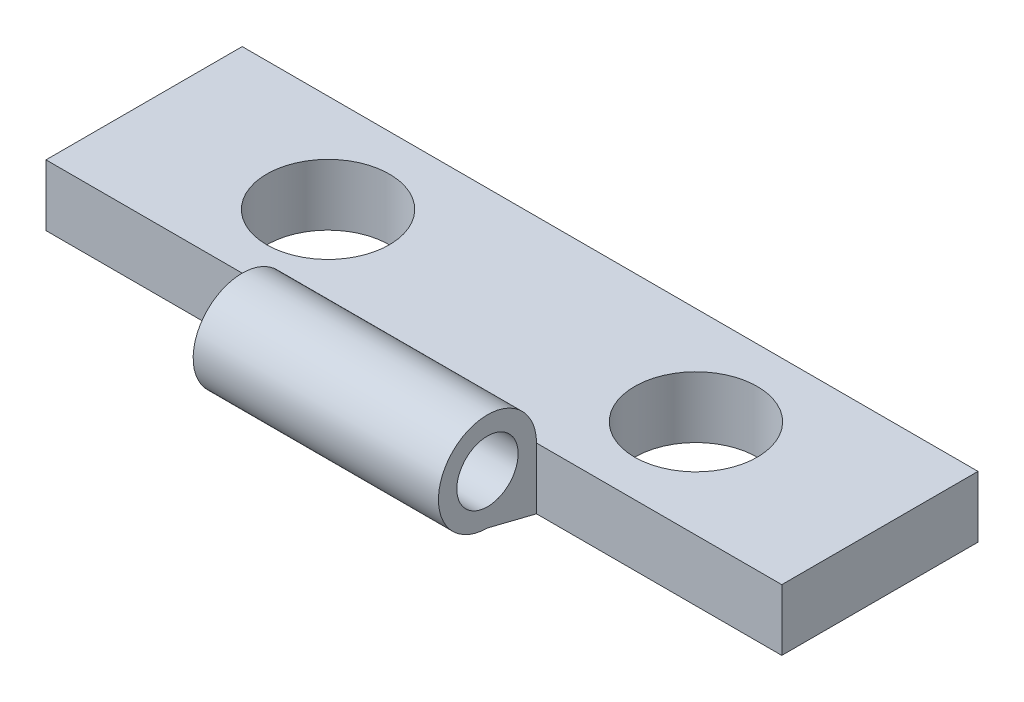
ISO-10303-21;
HEADER;
FILE_DESCRIPTION(('STEP AP214'),'2;1');
FILE_NAME('part.step','',(''),(''),'','','');
FILE_SCHEMA(('AUTOMOTIVE_DESIGN { 1 0 10303 214 1 1 1 1 }'));
ENDSEC;
DATA;
#1=APPLICATION_CONTEXT('core data for automotive mechanical design processes');
#2=APPLICATION_PROTOCOL_DEFINITION('international standard','automotive_design',2000,#1);
#3=PRODUCT_CONTEXT('',#1,'mechanical');
#4=PRODUCT('Part','Part','',(#3));
#5=PRODUCT_RELATED_PRODUCT_CATEGORY('part','',(#4));
#6=PRODUCT_DEFINITION_FORMATION('','',#4);
#7=PRODUCT_DEFINITION_CONTEXT('part definition',#1,'design');
#8=PRODUCT_DEFINITION('design','',#6,#7);
#9=PRODUCT_DEFINITION_SHAPE('','',#8);
#10=(LENGTH_UNIT() NAMED_UNIT(*) SI_UNIT(.MILLI.,.METRE.));
#11=(NAMED_UNIT(*) PLANE_ANGLE_UNIT() SI_UNIT($,.RADIAN.));
#12=(NAMED_UNIT(*) SI_UNIT($,.STERADIAN.) SOLID_ANGLE_UNIT());
#13=UNCERTAINTY_MEASURE_WITH_UNIT(LENGTH_MEASURE(1.E-05),#10,'distance_accuracy_value','');
#14=(GEOMETRIC_REPRESENTATION_CONTEXT(3) GLOBAL_UNCERTAINTY_ASSIGNED_CONTEXT((#13)) GLOBAL_UNIT_ASSIGNED_CONTEXT((#10,
#11,#12)) REPRESENTATION_CONTEXT('',''));
#15=CARTESIAN_POINT('',(0.,0.,0.));
#16=DIRECTION('',(0.,0.,1.));
#17=DIRECTION('',(1.,0.,0.));
#18=AXIS2_PLACEMENT_3D('',#15,#16,#17);
#19=CARTESIAN_POINT('',(15.,2.5,4.));
#20=DIRECTION('',(-1.,0.,0.));
#21=DIRECTION('',(0.,0.,1.));
#22=AXIS2_PLACEMENT_3D('',#19,#20,#21);
#23=PLANE('',#22);
#24=DIRECTION('',(0.,-1.,0.));
#25=VECTOR('',#24,1.);
#26=CARTESIAN_POINT('',(15.,4.5,4.));
#27=LINE('',#26,#25);
#28=CARTESIAN_POINT('',(15.,2.5,4.));
#29=VERTEX_POINT('',#28);
#30=CARTESIAN_POINT('',(15.,0.,4.));
#31=VERTEX_POINT('',#30);
#32=EDGE_CURVE('E124',#29,#31,#27,.T.);
#33=ORIENTED_EDGE('',*,*,#32,.T.);
#34=DIRECTION('',(0.,0.,-1.));
#35=VECTOR('',#34,1.);
#36=CARTESIAN_POINT('',(15.,0.,4.));
#37=LINE('',#36,#35);
#38=CARTESIAN_POINT('',(15.,0.,-4.));
#39=VERTEX_POINT('',#38);
#40=EDGE_CURVE('E86',#31,#39,#37,.T.);
#41=ORIENTED_EDGE('',*,*,#40,.T.);
#42=DIRECTION('',(0.,-1.,0.));
#43=VECTOR('',#42,1.);
#44=CARTESIAN_POINT('',(15.,2.5,-4.));
#45=LINE('',#44,#43);
#46=CARTESIAN_POINT('',(15.,2.5,-4.));
#47=VERTEX_POINT('',#46);
#48=EDGE_CURVE('E11',#47,#39,#45,.T.);
#49=ORIENTED_EDGE('',*,*,#48,.F.);
#50=DIRECTION('',(0.,0.,-1.));
#51=VECTOR('',#50,1.);
#52=CARTESIAN_POINT('',(15.,2.5,4.));
#53=LINE('',#52,#51);
#54=EDGE_CURVE('E106',#29,#47,#53,.T.);
#55=ORIENTED_EDGE('',*,*,#54,.F.);
#56=EDGE_LOOP('',(#33,#41,#49,#55));
#57=FACE_BOUND('',#56,.T.);
#58=ADVANCED_FACE('F40',(#57),#23,.F.);
#59=CARTESIAN_POINT('',(-15.,2.5,4.));
#60=DIRECTION('',(1.,0.,0.));
#61=DIRECTION('',(0.,0.,-1.));
#62=AXIS2_PLACEMENT_3D('',#59,#60,#61);
#63=PLANE('',#62);
#64=DIRECTION('',(0.,-1.,0.));
#65=VECTOR('',#64,1.);
#66=CARTESIAN_POINT('',(-15.,4.5,4.));
#67=LINE('',#66,#65);
#68=CARTESIAN_POINT('',(-15.,2.5,4.));
#69=VERTEX_POINT('',#68);
#70=CARTESIAN_POINT('',(-15.,0.,4.));
#71=VERTEX_POINT('',#70);
#72=EDGE_CURVE('E110',#69,#71,#67,.T.);
#73=ORIENTED_EDGE('',*,*,#72,.F.);
#74=DIRECTION('',(0.,0.,1.));
#75=VECTOR('',#74,1.);
#76=CARTESIAN_POINT('',(-15.,2.5,4.));
#77=LINE('',#76,#75);
#78=CARTESIAN_POINT('',(-15.,2.5,-4.));
#79=VERTEX_POINT('',#78);
#80=EDGE_CURVE('E92',#79,#69,#77,.T.);
#81=ORIENTED_EDGE('',*,*,#80,.F.);
#82=DIRECTION('',(0.,-1.,0.));
#83=VECTOR('',#82,1.);
#84=CARTESIAN_POINT('',(-15.,2.5,-4.));
#85=LINE('',#84,#83);
#86=CARTESIAN_POINT('',(-15.,0.,-4.));
#87=VERTEX_POINT('',#86);
#88=EDGE_CURVE('E48',#79,#87,#85,.T.);
#89=ORIENTED_EDGE('',*,*,#88,.T.);
#90=DIRECTION('',(0.,0.,1.));
#91=VECTOR('',#90,1.);
#92=CARTESIAN_POINT('',(-15.,0.,4.));
#93=LINE('',#92,#91);
#94=EDGE_CURVE('E85',#87,#71,#93,.T.);
#95=ORIENTED_EDGE('',*,*,#94,.T.);
#96=EDGE_LOOP('',(#73,#81,#89,#95));
#97=FACE_BOUND('',#96,.T.);
#98=ADVANCED_FACE('F91',(#97),#63,.F.);
#99=CARTESIAN_POINT('',(21.0207972893961,2.5,6.));
#100=DIRECTION('',(-1.,0.,0.));
#101=DIRECTION('',(0.,0.,1.));
#102=AXIS2_PLACEMENT_3D('',#99,#100,#101);
#103=CYLINDRICAL_SURFACE('',#102,2.);
#104=CARTESIAN_POINT('',(-5.,2.5,6.));
#105=DIRECTION('',(-1.,0.,0.));
#106=DIRECTION('',(0.,0.,1.));
#107=AXIS2_PLACEMENT_3D('',#104,#105,#106);
#108=CIRCLE('',#107,2.);
#109=CARTESIAN_POINT('',(-5.,0.499999999999999,6.));
#110=VERTEX_POINT('',#109);
#111=CARTESIAN_POINT('',(-5.,2.5,4.));
#112=VERTEX_POINT('',#111);
#113=EDGE_CURVE('E135',#110,#112,#108,.T.);
#114=ORIENTED_EDGE('',*,*,#113,.F.);
#115=DIRECTION('',(-1.,0.,0.));
#116=VECTOR('',#115,1.);
#117=CARTESIAN_POINT('',(21.0207972893961,0.5,6.));
#118=LINE('',#117,#116);
#119=CARTESIAN_POINT('',(5.,0.499999999999999,6.));
#120=VERTEX_POINT('',#119);
#121=EDGE_CURVE('E140',#120,#110,#118,.T.);
#122=ORIENTED_EDGE('',*,*,#121,.F.);
#123=CARTESIAN_POINT('',(5.,2.5,6.));
#124=DIRECTION('',(1.,0.,0.));
#125=DIRECTION('',(0.,0.,-1.));
#126=AXIS2_PLACEMENT_3D('',#123,#124,#125);
#127=CIRCLE('',#126,2.);
#128=CARTESIAN_POINT('',(5.,2.5,4.));
#129=VERTEX_POINT('',#128);
#130=EDGE_CURVE('E113',#129,#120,#127,.T.);
#131=ORIENTED_EDGE('',*,*,#130,.F.);
#132=DIRECTION('',(1.,0.,0.));
#133=VECTOR('',#132,1.);
#134=CARTESIAN_POINT('',(-15.,2.5,4.));
#135=LINE('',#134,#133);
#136=EDGE_CURVE('E158',#112,#129,#135,.T.);
#137=ORIENTED_EDGE('',*,*,#136,.F.);
#138=EDGE_LOOP('',(#114,#122,#131,#137));
#139=FACE_BOUND('',#138,.T.);
#140=ADVANCED_FACE('F212',(#139),#103,.T.);
#141=CARTESIAN_POINT('',(21.0207972893961,0.,4.));
#142=DIRECTION('',(0.,0.970142500145332,-0.242535625036333));
#143=DIRECTION('',(0.,0.242535625036333,0.970142500145332));
#144=AXIS2_PLACEMENT_3D('',#141,#142,#143);
#145=PLANE('',#144);
#146=DIRECTION('',(0.,0.242535625036333,0.970142500145332));
#147=VECTOR('',#146,1.);
#148=CARTESIAN_POINT('',(-5.,0.,4.00000000000001));
#149=LINE('',#148,#147);
#150=CARTESIAN_POINT('',(-5.,0.,4.));
#151=VERTEX_POINT('',#150);
#152=EDGE_CURVE('E132',#151,#110,#149,.T.);
#153=ORIENTED_EDGE('',*,*,#152,.F.);
#154=DIRECTION('',(1.,0.,0.));
#155=VECTOR('',#154,1.);
#156=CARTESIAN_POINT('',(-15.,0.,4.));
#157=LINE('',#156,#155);
#158=CARTESIAN_POINT('',(5.,0.,4.));
#159=VERTEX_POINT('',#158);
#160=EDGE_CURVE('E101',#151,#159,#157,.T.);
#161=ORIENTED_EDGE('',*,*,#160,.T.);
#162=DIRECTION('',(0.,-0.242535625036333,-0.970142500145332));
#163=VECTOR('',#162,1.);
#164=CARTESIAN_POINT('',(5.,0.,4.));
#165=LINE('',#164,#163);
#166=EDGE_CURVE('E109',#120,#159,#165,.T.);
#167=ORIENTED_EDGE('',*,*,#166,.F.);
#168=ORIENTED_EDGE('',*,*,#121,.T.);
#169=EDGE_LOOP('',(#153,#161,#167,#168));
#170=FACE_BOUND('',#169,.T.);
#171=ADVANCED_FACE('F188',(#170),#145,.F.);
#172=CARTESIAN_POINT('',(0.,2.5,0.));
#173=DIRECTION('',(0.,-1.,0.));
#174=DIRECTION('',(0.,0.,-1.));
#175=AXIS2_PLACEMENT_3D('',#172,#173,#174);
#176=PLANE('',#175);
#177=ORIENTED_EDGE('',*,*,#54,.T.);
#178=DIRECTION('',(-1.,0.,0.));
#179=VECTOR('',#178,1.);
#180=CARTESIAN_POINT('',(-15.,2.5,-4.));
#181=LINE('',#180,#179);
#182=EDGE_CURVE('E65',#47,#79,#181,.T.);
#183=ORIENTED_EDGE('',*,*,#182,.T.);
#184=ORIENTED_EDGE('',*,*,#80,.T.);
#185=EDGE_CURVE('E93',#69,#112,#135,.T.);
#186=ORIENTED_EDGE('',*,*,#185,.T.);
#187=ORIENTED_EDGE('',*,*,#136,.T.);
#188=DIRECTION('',(-1.,0.,0.));
#189=VECTOR('',#188,1.);
#190=CARTESIAN_POINT('',(21.0207972893961,2.5,4.));
#191=LINE('',#190,#189);
#192=EDGE_CURVE('E138',#29,#129,#191,.T.);
#193=ORIENTED_EDGE('',*,*,#192,.F.);
#194=EDGE_LOOP('',(#177,#183,#184,#186,#187,#193));
#195=FACE_BOUND('',#194,.T.);
#196=CARTESIAN_POINT('',(-7.5,2.5,0.));
#197=DIRECTION('',(0.,1.,0.));
#198=DIRECTION('',(0.,0.,1.));
#199=AXIS2_PLACEMENT_3D('',#196,#197,#198);
#200=CIRCLE('',#199,2.5);
#201=CARTESIAN_POINT('',(-7.5,2.5,2.5));
#202=VERTEX_POINT('',#201);
#203=EDGE_CURVE('E150',#202,#202,#200,.T.);
#204=ORIENTED_EDGE('',*,*,#203,.F.);
#205=EDGE_LOOP('',(#204));
#206=FACE_BOUND('',#205,.T.);
#207=CARTESIAN_POINT('',(7.5,2.5,0.));
#208=DIRECTION('',(0.,1.,0.));
#209=DIRECTION('',(0.,0.,1.));
#210=AXIS2_PLACEMENT_3D('',#207,#208,#209);
#211=CIRCLE('',#210,2.5);
#212=CARTESIAN_POINT('',(7.5,2.5,2.5));
#213=VERTEX_POINT('',#212);
#214=EDGE_CURVE('E144',#213,#213,#211,.T.);
#215=ORIENTED_EDGE('',*,*,#214,.F.);
#216=EDGE_LOOP('',(#215));
#217=FACE_BOUND('',#216,.T.);
#218=ADVANCED_FACE('F184',(#195,#206,#217),#176,.F.);
#219=CARTESIAN_POINT('',(0.,0.,0.));
#220=DIRECTION('',(0.,-1.,0.));
#221=DIRECTION('',(0.,0.,-1.));
#222=AXIS2_PLACEMENT_3D('',#219,#220,#221);
#223=PLANE('',#222);
#224=CARTESIAN_POINT('',(-7.5,0.,0.));
#225=DIRECTION('',(0.,1.,0.));
#226=DIRECTION('',(0.,0.,1.));
#227=AXIS2_PLACEMENT_3D('',#224,#225,#226);
#228=CIRCLE('',#227,2.5);
#229=CARTESIAN_POINT('',(-7.5,0.,2.5));
#230=VERTEX_POINT('',#229);
#231=EDGE_CURVE('E147',#230,#230,#228,.T.);
#232=ORIENTED_EDGE('',*,*,#231,.T.);
#233=EDGE_LOOP('',(#232));
#234=FACE_BOUND('',#233,.T.);
#235=ORIENTED_EDGE('',*,*,#40,.F.);
#236=DIRECTION('',(-1.,0.,0.));
#237=VECTOR('',#236,1.);
#238=CARTESIAN_POINT('',(5.,0.,4.));
#239=LINE('',#238,#237);
#240=EDGE_CURVE('E121',#31,#159,#239,.T.);
#241=ORIENTED_EDGE('',*,*,#240,.T.);
#242=ORIENTED_EDGE('',*,*,#160,.F.);
#243=EDGE_CURVE('E100',#71,#151,#157,.T.);
#244=ORIENTED_EDGE('',*,*,#243,.F.);
#245=ORIENTED_EDGE('',*,*,#94,.F.);
#246=DIRECTION('',(-1.,0.,0.));
#247=VECTOR('',#246,1.);
#248=CARTESIAN_POINT('',(-15.,0.,-4.));
#249=LINE('',#248,#247);
#250=EDGE_CURVE('E76',#39,#87,#249,.T.);
#251=ORIENTED_EDGE('',*,*,#250,.F.);
#252=EDGE_LOOP('',(#235,#241,#242,#244,#245,#251));
#253=FACE_BOUND('',#252,.T.);
#254=CARTESIAN_POINT('',(7.5,0.,0.));
#255=DIRECTION('',(0.,1.,0.));
#256=DIRECTION('',(0.,0.,1.));
#257=AXIS2_PLACEMENT_3D('',#254,#255,#256);
#258=CIRCLE('',#257,2.5);
#259=CARTESIAN_POINT('',(7.5,0.,2.5));
#260=VERTEX_POINT('',#259);
#261=EDGE_CURVE('E143',#260,#260,#258,.T.);
#262=ORIENTED_EDGE('',*,*,#261,.T.);
#263=EDGE_LOOP('',(#262));
#264=FACE_BOUND('',#263,.T.);
#265=ADVANCED_FACE('F96',(#234,#253,#264),#223,.T.);
#266=CARTESIAN_POINT('',(-15.,2.5,-4.));
#267=DIRECTION('',(0.,0.,1.));
#268=DIRECTION('',(1.,0.,0.));
#269=AXIS2_PLACEMENT_3D('',#266,#267,#268);
#270=PLANE('',#269);
#271=ORIENTED_EDGE('',*,*,#250,.T.);
#272=ORIENTED_EDGE('',*,*,#88,.F.);
#273=ORIENTED_EDGE('',*,*,#182,.F.);
#274=ORIENTED_EDGE('',*,*,#48,.T.);
#275=EDGE_LOOP('',(#271,#272,#273,#274));
#276=FACE_BOUND('',#275,.T.);
#277=ADVANCED_FACE('F78',(#276),#270,.F.);
#278=CARTESIAN_POINT('',(-7.5,2.5,0.));
#279=DIRECTION('',(0.,-1.,0.));
#280=DIRECTION('',(0.,0.,-1.));
#281=AXIS2_PLACEMENT_3D('',#278,#279,#280);
#282=CYLINDRICAL_SURFACE('',#281,2.5);
#283=ORIENTED_EDGE('',*,*,#203,.T.);
#284=EDGE_LOOP('',(#283));
#285=FACE_BOUND('',#284,.T.);
#286=ORIENTED_EDGE('',*,*,#231,.F.);
#287=EDGE_LOOP('',(#286));
#288=FACE_BOUND('',#287,.T.);
#289=ADVANCED_FACE('F198',(#285,#288),#282,.F.);
#290=CARTESIAN_POINT('',(7.5,2.5,0.));
#291=DIRECTION('',(0.,-1.,0.));
#292=DIRECTION('',(0.,0.,-1.));
#293=AXIS2_PLACEMENT_3D('',#290,#291,#292);
#294=CYLINDRICAL_SURFACE('',#293,2.5);
#295=ORIENTED_EDGE('',*,*,#214,.T.);
#296=EDGE_LOOP('',(#295));
#297=FACE_BOUND('',#296,.T.);
#298=ORIENTED_EDGE('',*,*,#261,.F.);
#299=EDGE_LOOP('',(#298));
#300=FACE_BOUND('',#299,.T.);
#301=ADVANCED_FACE('F194',(#297,#300),#294,.F.);
#302=CARTESIAN_POINT('',(5.,4.5,4.));
#303=DIRECTION('',(0.,0.,1.));
#304=DIRECTION('',(1.,0.,0.));
#305=AXIS2_PLACEMENT_3D('',#302,#303,#304);
#306=PLANE('',#305);
#307=ORIENTED_EDGE('',*,*,#192,.T.);
#308=DIRECTION('',(0.,-1.,0.));
#309=VECTOR('',#308,1.);
#310=CARTESIAN_POINT('',(5.,4.5,4.));
#311=LINE('',#310,#309);
#312=EDGE_CURVE('E56',#129,#159,#311,.T.);
#313=ORIENTED_EDGE('',*,*,#312,.T.);
#314=ORIENTED_EDGE('',*,*,#240,.F.);
#315=ORIENTED_EDGE('',*,*,#32,.F.);
#316=EDGE_LOOP('',(#307,#313,#314,#315));
#317=FACE_BOUND('',#316,.T.);
#318=ADVANCED_FACE('F197',(#317),#306,.T.);
#319=CARTESIAN_POINT('',(5.,4.5,4.));
#320=DIRECTION('',(1.,0.,0.));
#321=DIRECTION('',(0.,0.,-1.));
#322=AXIS2_PLACEMENT_3D('',#319,#320,#321);
#323=PLANE('',#322);
#324=CARTESIAN_POINT('',(5.,2.5,6.));
#325=DIRECTION('',(1.,0.,0.));
#326=DIRECTION('',(0.,0.,-1.));
#327=AXIS2_PLACEMENT_3D('',#324,#325,#326);
#328=CIRCLE('',#327,1.25);
#329=CARTESIAN_POINT('',(5.,2.5,4.75));
#330=VERTEX_POINT('',#329);
#331=EDGE_CURVE('E107',#330,#330,#328,.T.);
#332=ORIENTED_EDGE('',*,*,#331,.F.);
#333=EDGE_LOOP('',(#332));
#334=FACE_BOUND('',#333,.T.);
#335=ORIENTED_EDGE('',*,*,#130,.T.);
#336=ORIENTED_EDGE('',*,*,#166,.T.);
#337=ORIENTED_EDGE('',*,*,#312,.F.);
#338=EDGE_LOOP('',(#335,#336,#337));
#339=FACE_BOUND('',#338,.T.);
#340=ADVANCED_FACE('F247',(#334,#339),#323,.T.);
#341=CARTESIAN_POINT('',(-15.,4.5,4.));
#342=DIRECTION('',(0.,0.,1.));
#343=DIRECTION('',(1.,0.,0.));
#344=AXIS2_PLACEMENT_3D('',#341,#342,#343);
#345=PLANE('',#344);
#346=ORIENTED_EDGE('',*,*,#185,.F.);
#347=ORIENTED_EDGE('',*,*,#72,.T.);
#348=ORIENTED_EDGE('',*,*,#243,.T.);
#349=DIRECTION('',(0.,-1.,0.));
#350=VECTOR('',#349,1.);
#351=CARTESIAN_POINT('',(-5.,4.5,4.));
#352=LINE('',#351,#350);
#353=EDGE_CURVE('E116',#112,#151,#352,.T.);
#354=ORIENTED_EDGE('',*,*,#353,.F.);
#355=EDGE_LOOP('',(#346,#347,#348,#354));
#356=FACE_BOUND('',#355,.T.);
#357=ADVANCED_FACE('F181',(#356),#345,.T.);
#358=CARTESIAN_POINT('',(-5.,4.5,4.));
#359=DIRECTION('',(-1.,0.,0.));
#360=DIRECTION('',(0.,0.,1.));
#361=AXIS2_PLACEMENT_3D('',#358,#359,#360);
#362=PLANE('',#361);
#363=CARTESIAN_POINT('',(-5.,2.5,6.));
#364=DIRECTION('',(-1.,0.,0.));
#365=DIRECTION('',(0.,0.,1.));
#366=AXIS2_PLACEMENT_3D('',#363,#364,#365);
#367=CIRCLE('',#366,1.25);
#368=CARTESIAN_POINT('',(-5.,2.5,7.25));
#369=VERTEX_POINT('',#368);
#370=EDGE_CURVE('E43',#369,#369,#367,.T.);
#371=ORIENTED_EDGE('',*,*,#370,.F.);
#372=EDGE_LOOP('',(#371));
#373=FACE_BOUND('',#372,.T.);
#374=ORIENTED_EDGE('',*,*,#113,.T.);
#375=ORIENTED_EDGE('',*,*,#353,.T.);
#376=ORIENTED_EDGE('',*,*,#152,.T.);
#377=EDGE_LOOP('',(#374,#375,#376));
#378=FACE_BOUND('',#377,.T.);
#379=ADVANCED_FACE('F227',(#373,#378),#362,.T.);
#380=CARTESIAN_POINT('',(21.0207972893961,2.5,6.));
#381=DIRECTION('',(-1.,0.,0.));
#382=DIRECTION('',(0.,0.,1.));
#383=AXIS2_PLACEMENT_3D('',#380,#381,#382);
#384=CYLINDRICAL_SURFACE('',#383,1.25);
#385=ORIENTED_EDGE('',*,*,#331,.T.);
#386=EDGE_LOOP('',(#385));
#387=FACE_BOUND('',#386,.T.);
#388=ORIENTED_EDGE('',*,*,#370,.T.);
#389=EDGE_LOOP('',(#388));
#390=FACE_BOUND('',#389,.T.);
#391=ADVANCED_FACE('F225',(#387,#390),#384,.F.);
#392=CLOSED_SHELL('',(#58,#98,#140,#171,#218,#265,#277,#289,#301,#318,#340,#357,#379,#391));
#393=MANIFOLD_SOLID_BREP('B2',#392);
#394=ADVANCED_BREP_SHAPE_REPRESENTATION('',(#18,#393),#14);
#395=SHAPE_DEFINITION_REPRESENTATION(#9,#394);
ENDSEC;
END-ISO-10303-21;
